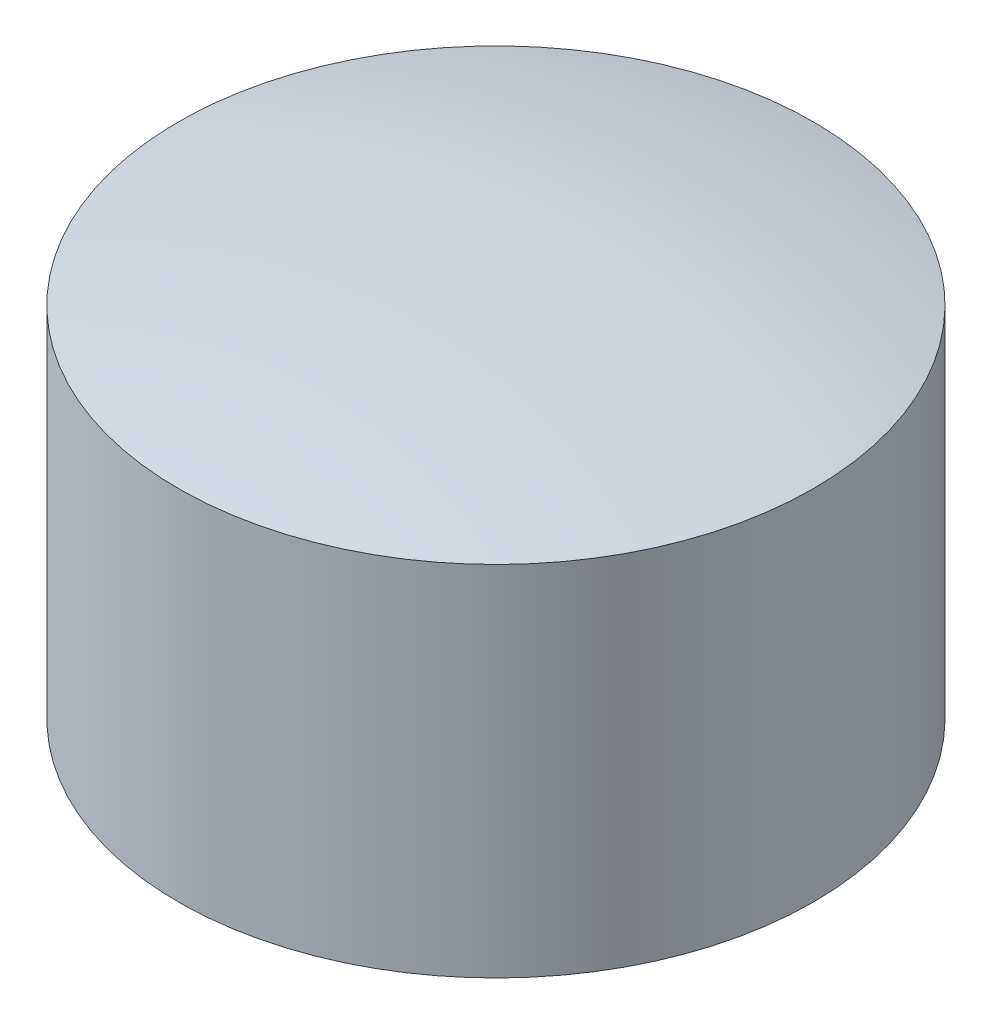
ISO-10303-21;
HEADER;
FILE_DESCRIPTION(('STEP AP214'),'2;1');
FILE_NAME('part.step','',(''),(''),'','','');
FILE_SCHEMA(('AUTOMOTIVE_DESIGN { 1 0 10303 214 1 1 1 1 }'));
ENDSEC;
DATA;
#1=APPLICATION_CONTEXT('core data for automotive mechanical design processes');
#2=APPLICATION_PROTOCOL_DEFINITION('international standard','automotive_design',2000,#1);
#3=PRODUCT_CONTEXT('',#1,'mechanical');
#4=PRODUCT('Part','Part','',(#3));
#5=PRODUCT_RELATED_PRODUCT_CATEGORY('part','',(#4));
#6=PRODUCT_DEFINITION_FORMATION('','',#4);
#7=PRODUCT_DEFINITION_CONTEXT('part definition',#1,'design');
#8=PRODUCT_DEFINITION('design','',#6,#7);
#9=PRODUCT_DEFINITION_SHAPE('','',#8);
#10=(LENGTH_UNIT() NAMED_UNIT(*) SI_UNIT(.MILLI.,.METRE.));
#11=(NAMED_UNIT(*) PLANE_ANGLE_UNIT() SI_UNIT($,.RADIAN.));
#12=(NAMED_UNIT(*) SI_UNIT($,.STERADIAN.) SOLID_ANGLE_UNIT());
#13=UNCERTAINTY_MEASURE_WITH_UNIT(LENGTH_MEASURE(1.E-05),#10,'distance_accuracy_value','');
#14=(GEOMETRIC_REPRESENTATION_CONTEXT(3) GLOBAL_UNCERTAINTY_ASSIGNED_CONTEXT((#13)) GLOBAL_UNIT_ASSIGNED_CONTEXT((#10,
#11,#12)) REPRESENTATION_CONTEXT('',''));
#15=CARTESIAN_POINT('',(0.,0.,0.));
#16=DIRECTION('',(0.,0.,1.));
#17=DIRECTION('',(1.,0.,0.));
#18=AXIS2_PLACEMENT_3D('',#15,#16,#17);
#19=CARTESIAN_POINT('',(7.95807864051312E-13,6606.14017081412,-843.244434569781));
#20=DIRECTION('',(0.,0.,-1.));
#21=DIRECTION('',(0.,-1.,0.));
#22=AXIS2_PLACEMENT_3D('',#19,#20,#21);
#23=SPHERICAL_SURFACE('',#22,390.370052578088);
#24=CARTESIAN_POINT('',(-8.62144154274E-13,6219.38472101436,-843.244434569781));
#25=DIRECTION('',(0.,-1.,0.));
#26=DIRECTION('',(1.,0.,0.));
#27=AXIS2_PLACEMENT_3D('',#24,#25,#26);
#28=CIRCLE('',#27,53.);
#29=CARTESIAN_POINT('',(52.9999999999991,6219.38472101436,-843.244434569781));
#30=VERTEX_POINT('',#29);
#31=EDGE_CURVE('E19',#30,#30,#28,.F.);
#32=ORIENTED_EDGE('',*,*,#31,.F.);
#33=EDGE_LOOP('',(#32));
#34=FACE_BOUND('',#33,.T.);
#35=ADVANCED_FACE('F15',(#34),#23,.T.);
#36=CARTESIAN_POINT('',(0.,6070.34008854715,-843.244434569781));
#37=DIRECTION('',(0.,0.,-1.));
#38=DIRECTION('',(0.,1.,0.));
#39=AXIS2_PLACEMENT_3D('',#36,#37,#38);
#40=SPHERICAL_SURFACE('',#39,215.430029688889);
#41=CARTESIAN_POINT('',(1.63424829224839E-13,6279.14884720386,-843.244434569781));
#42=DIRECTION('',(0.,-1.,0.));
#43=DIRECTION('',(1.,0.,0.));
#44=AXIS2_PLACEMENT_3D('',#41,#42,#43);
#45=CIRCLE('',#44,53.);
#46=CARTESIAN_POINT('',(53.0000000000002,6279.14884720386,-843.244434569781));
#47=VERTEX_POINT('',#46);
#48=EDGE_CURVE('E10',#47,#47,#45,.T.);
#49=ORIENTED_EDGE('',*,*,#48,.F.);
#50=EDGE_LOOP('',(#49));
#51=FACE_BOUND('',#50,.T.);
#52=ADVANCED_FACE('F30',(#51),#40,.T.);
#53=CARTESIAN_POINT('',(1.63424829224823E-13,6279.14884720386,-843.244434569781));
#54=DIRECTION('',(0.,-1.,0.));
#55=DIRECTION('',(1.,0.,0.));
#56=AXIS2_PLACEMENT_3D('',#53,#54,#55);
#57=CYLINDRICAL_SURFACE('',#56,53.);
#58=ORIENTED_EDGE('',*,*,#48,.T.);
#59=EDGE_LOOP('',(#58));
#60=FACE_BOUND('',#59,.T.);
#61=ORIENTED_EDGE('',*,*,#31,.T.);
#62=EDGE_LOOP('',(#61));
#63=FACE_BOUND('',#62,.T.);
#64=ADVANCED_FACE('F17',(#60,#63),#57,.T.);
#65=CLOSED_SHELL('',(#35,#52,#64));
#66=MANIFOLD_SOLID_BREP('B1',#65);
#67=ADVANCED_BREP_SHAPE_REPRESENTATION('',(#18,#66),#14);
#68=SHAPE_DEFINITION_REPRESENTATION(#9,#67);
ENDSEC;
END-ISO-10303-21;
